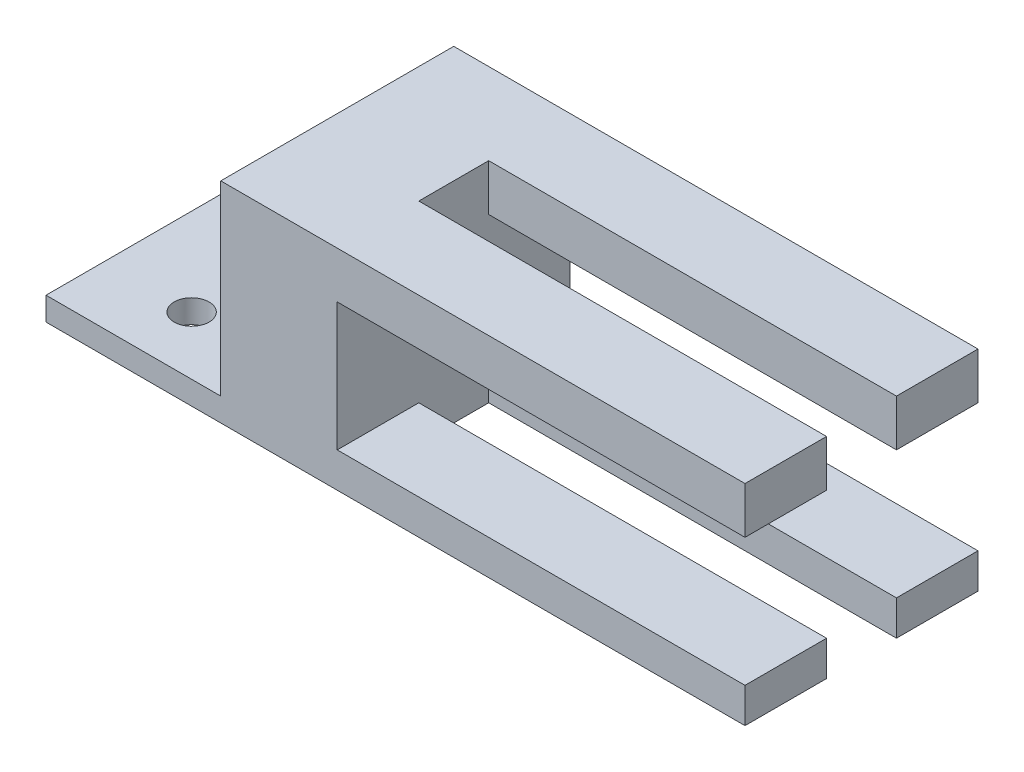
ISO-10303-21;
HEADER;
FILE_DESCRIPTION(('STEP AP214'),'2;1');
FILE_NAME('part.step','',(''),(''),'','','');
FILE_SCHEMA(('AUTOMOTIVE_DESIGN { 1 0 10303 214 1 1 1 1 }'));
ENDSEC;
DATA;
#1=APPLICATION_CONTEXT('core data for automotive mechanical design processes');
#2=APPLICATION_PROTOCOL_DEFINITION('international standard','automotive_design',2000,#1);
#3=PRODUCT_CONTEXT('',#1,'mechanical');
#4=PRODUCT('Part','Part','',(#3));
#5=PRODUCT_RELATED_PRODUCT_CATEGORY('part','',(#4));
#6=PRODUCT_DEFINITION_FORMATION('','',#4);
#7=PRODUCT_DEFINITION_CONTEXT('part definition',#1,'design');
#8=PRODUCT_DEFINITION('design','',#6,#7);
#9=PRODUCT_DEFINITION_SHAPE('','',#8);
#10=(LENGTH_UNIT() NAMED_UNIT(*) SI_UNIT(.MILLI.,.METRE.));
#11=(NAMED_UNIT(*) PLANE_ANGLE_UNIT() SI_UNIT($,.RADIAN.));
#12=(NAMED_UNIT(*) SI_UNIT($,.STERADIAN.) SOLID_ANGLE_UNIT());
#13=UNCERTAINTY_MEASURE_WITH_UNIT(LENGTH_MEASURE(1.E-05),#10,'distance_accuracy_value','');
#14=(GEOMETRIC_REPRESENTATION_CONTEXT(3) GLOBAL_UNCERTAINTY_ASSIGNED_CONTEXT((#13)) GLOBAL_UNIT_ASSIGNED_CONTEXT((#10,
#11,#12)) REPRESENTATION_CONTEXT('',''));
#15=CARTESIAN_POINT('',(0.,0.,0.));
#16=DIRECTION('',(0.,0.,1.));
#17=DIRECTION('',(1.,0.,0.));
#18=AXIS2_PLACEMENT_3D('',#15,#16,#17);
#19=CARTESIAN_POINT('',(5.,15.,-10.));
#20=DIRECTION('',(1.,0.,0.));
#21=DIRECTION('',(0.,1.,0.));
#22=AXIS2_PLACEMENT_3D('',#19,#20,#21);
#23=PLANE('',#22);
#24=DIRECTION('',(0.,0.,1.));
#25=VECTOR('',#24,1.);
#26=CARTESIAN_POINT('',(5.,11.,-10.));
#27=LINE('',#26,#25);
#28=CARTESIAN_POINT('',(5.,11.,-10.));
#29=VERTEX_POINT('',#28);
#30=CARTESIAN_POINT('',(5.,11.,-3.));
#31=VERTEX_POINT('',#30);
#32=EDGE_CURVE('E202',#29,#31,#27,.T.);
#33=ORIENTED_EDGE('',*,*,#32,.T.);
#34=DIRECTION('',(0.,1.,0.));
#35=VECTOR('',#34,1.);
#36=CARTESIAN_POINT('',(5.,15.,-3.));
#37=LINE('',#36,#35);
#38=CARTESIAN_POINT('',(5.,15.,-3.));
#39=VERTEX_POINT('',#38);
#40=EDGE_CURVE('E205',#31,#39,#37,.T.);
#41=ORIENTED_EDGE('',*,*,#40,.T.);
#42=DIRECTION('',(0.,0.,1.));
#43=VECTOR('',#42,1.);
#44=CARTESIAN_POINT('',(5.,15.,-10.));
#45=LINE('',#44,#43);
#46=CARTESIAN_POINT('',(5.,15.,3.));
#47=VERTEX_POINT('',#46);
#48=EDGE_CURVE('E310',#39,#47,#45,.T.);
#49=ORIENTED_EDGE('',*,*,#48,.T.);
#50=DIRECTION('',(0.,-1.,0.));
#51=VECTOR('',#50,1.);
#52=CARTESIAN_POINT('',(5.,15.,3.));
#53=LINE('',#52,#51);
#54=CARTESIAN_POINT('',(5.,11.,3.));
#55=VERTEX_POINT('',#54);
#56=EDGE_CURVE('E11',#47,#55,#53,.T.);
#57=ORIENTED_EDGE('',*,*,#56,.T.);
#58=DIRECTION('',(0.,0.,1.));
#59=VECTOR('',#58,1.);
#60=CARTESIAN_POINT('',(5.,11.,-10.));
#61=LINE('',#60,#59);
#62=CARTESIAN_POINT('',(5.,11.,10.));
#63=VERTEX_POINT('',#62);
#64=EDGE_CURVE('E272',#55,#63,#61,.T.);
#65=ORIENTED_EDGE('',*,*,#64,.T.);
#66=DIRECTION('',(0.,1.,0.));
#67=VECTOR('',#66,1.);
#68=CARTESIAN_POINT('',(5.,15.,10.));
#69=LINE('',#68,#67);
#70=CARTESIAN_POINT('',(5.,0.,10.));
#71=VERTEX_POINT('',#70);
#72=EDGE_CURVE('E300',#71,#63,#69,.T.);
#73=ORIENTED_EDGE('',*,*,#72,.F.);
#74=DIRECTION('',(0.,0.,-1.));
#75=VECTOR('',#74,1.);
#76=CARTESIAN_POINT('',(5.,0.,-10.));
#77=LINE('',#76,#75);
#78=CARTESIAN_POINT('',(5.,0.,3.));
#79=VERTEX_POINT('',#78);
#80=EDGE_CURVE('E247',#71,#79,#77,.T.);
#81=ORIENTED_EDGE('',*,*,#80,.T.);
#82=DIRECTION('',(0.,-1.,0.));
#83=VECTOR('',#82,1.);
#84=CARTESIAN_POINT('',(5.,15.,3.));
#85=LINE('',#84,#83);
#86=CARTESIAN_POINT('',(5.,-3.,3.));
#87=VERTEX_POINT('',#86);
#88=EDGE_CURVE('E250',#79,#87,#85,.T.);
#89=ORIENTED_EDGE('',*,*,#88,.T.);
#90=DIRECTION('',(0.,0.,1.));
#91=VECTOR('',#90,1.);
#92=CARTESIAN_POINT('',(5.00000000000001,-3.,-10.));
#93=LINE('',#92,#91);
#94=CARTESIAN_POINT('',(5.00000000000001,-3.,-3.));
#95=VERTEX_POINT('',#94);
#96=EDGE_CURVE('E174',#95,#87,#93,.T.);
#97=ORIENTED_EDGE('',*,*,#96,.F.);
#98=DIRECTION('',(0.,1.,0.));
#99=VECTOR('',#98,1.);
#100=CARTESIAN_POINT('',(5.,15.,-3.));
#101=LINE('',#100,#99);
#102=CARTESIAN_POINT('',(5.,0.,-3.));
#103=VERTEX_POINT('',#102);
#104=EDGE_CURVE('E227',#95,#103,#101,.T.);
#105=ORIENTED_EDGE('',*,*,#104,.T.);
#106=DIRECTION('',(0.,0.,-1.));
#107=VECTOR('',#106,1.);
#108=CARTESIAN_POINT('',(5.,0.,-10.));
#109=LINE('',#108,#107);
#110=CARTESIAN_POINT('',(5.,0.,-10.));
#111=VERTEX_POINT('',#110);
#112=EDGE_CURVE('E224',#103,#111,#109,.T.);
#113=ORIENTED_EDGE('',*,*,#112,.T.);
#114=DIRECTION('',(0.,1.,0.));
#115=VECTOR('',#114,1.);
#116=CARTESIAN_POINT('',(5.,15.,-10.));
#117=LINE('',#116,#115);
#118=EDGE_CURVE('E175',#111,#29,#117,.T.);
#119=ORIENTED_EDGE('',*,*,#118,.T.);
#120=EDGE_LOOP('',(#33,#41,#49,#57,#65,#73,#81,#89,#97,#105,#113,#119));
#121=FACE_BOUND('',#120,.T.);
#122=ADVANCED_FACE('F35',(#121),#23,.T.);
#123=CARTESIAN_POINT('',(-5.,15.,-10.));
#124=DIRECTION('',(-1.,0.,0.));
#125=DIRECTION('',(0.,-1.,0.));
#126=AXIS2_PLACEMENT_3D('',#123,#124,#125);
#127=PLANE('',#126);
#128=DIRECTION('',(0.,0.,-1.));
#129=VECTOR('',#128,1.);
#130=CARTESIAN_POINT('',(-4.99999999999999,-1.,-10.));
#131=LINE('',#130,#129);
#132=CARTESIAN_POINT('',(-4.99999999999999,-1.,10.));
#133=VERTEX_POINT('',#132);
#134=CARTESIAN_POINT('',(-4.99999999999999,-1.,-10.));
#135=VERTEX_POINT('',#134);
#136=EDGE_CURVE('E291',#133,#135,#131,.T.);
#137=ORIENTED_EDGE('',*,*,#136,.F.);
#138=DIRECTION('',(0.,-1.,0.));
#139=VECTOR('',#138,1.);
#140=CARTESIAN_POINT('',(-5.,15.,10.));
#141=LINE('',#140,#139);
#142=CARTESIAN_POINT('',(-5.,15.,10.));
#143=VERTEX_POINT('',#142);
#144=EDGE_CURVE('E295',#143,#133,#141,.T.);
#145=ORIENTED_EDGE('',*,*,#144,.F.);
#146=DIRECTION('',(0.,0.,1.));
#147=VECTOR('',#146,1.);
#148=CARTESIAN_POINT('',(-5.,15.,-10.));
#149=LINE('',#148,#147);
#150=CARTESIAN_POINT('',(-5.,15.,-10.));
#151=VERTEX_POINT('',#150);
#152=EDGE_CURVE('E44',#151,#143,#149,.T.);
#153=ORIENTED_EDGE('',*,*,#152,.F.);
#154=DIRECTION('',(0.,-1.,0.));
#155=VECTOR('',#154,1.);
#156=CARTESIAN_POINT('',(-5.,15.,-10.));
#157=LINE('',#156,#155);
#158=EDGE_CURVE('E170',#151,#135,#157,.T.);
#159=ORIENTED_EDGE('',*,*,#158,.T.);
#160=EDGE_LOOP('',(#137,#145,#153,#159));
#161=FACE_BOUND('',#160,.T.);
#162=ADVANCED_FACE('F37',(#161),#127,.T.);
#163=CARTESIAN_POINT('',(-5.,15.,-10.));
#164=DIRECTION('',(0.,1.,0.));
#165=DIRECTION('',(0.,0.,1.));
#166=AXIS2_PLACEMENT_3D('',#163,#164,#165);
#167=PLANE('',#166);
#168=ORIENTED_EDGE('',*,*,#48,.F.);
#169=DIRECTION('',(-1.,0.,0.));
#170=VECTOR('',#169,1.);
#171=CARTESIAN_POINT('',(40.,15.,-3.));
#172=LINE('',#171,#170);
#173=CARTESIAN_POINT('',(40.,15.,-3.));
#174=VERTEX_POINT('',#173);
#175=EDGE_CURVE('E181',#174,#39,#172,.T.);
#176=ORIENTED_EDGE('',*,*,#175,.F.);
#177=DIRECTION('',(0.,0.,1.));
#178=VECTOR('',#177,1.);
#179=CARTESIAN_POINT('',(40.,15.,-10.));
#180=LINE('',#179,#178);
#181=CARTESIAN_POINT('',(40.,15.,-10.));
#182=VERTEX_POINT('',#181);
#183=EDGE_CURVE('E178',#182,#174,#180,.T.);
#184=ORIENTED_EDGE('',*,*,#183,.F.);
#185=DIRECTION('',(-1.,0.,0.));
#186=VECTOR('',#185,1.);
#187=CARTESIAN_POINT('',(-5.,15.,-10.));
#188=LINE('',#187,#186);
#189=EDGE_CURVE('E163',#182,#151,#188,.T.);
#190=ORIENTED_EDGE('',*,*,#189,.T.);
#191=ORIENTED_EDGE('',*,*,#152,.T.);
#192=DIRECTION('',(-1.,0.,0.));
#193=VECTOR('',#192,1.);
#194=CARTESIAN_POINT('',(-5.,15.,10.));
#195=LINE('',#194,#193);
#196=CARTESIAN_POINT('',(40.,15.,10.));
#197=VERTEX_POINT('',#196);
#198=EDGE_CURVE('E302',#197,#143,#195,.T.);
#199=ORIENTED_EDGE('',*,*,#198,.F.);
#200=DIRECTION('',(0.,0.,1.));
#201=VECTOR('',#200,1.);
#202=CARTESIAN_POINT('',(40.,15.,10.));
#203=LINE('',#202,#201);
#204=CARTESIAN_POINT('',(40.,15.,3.));
#205=VERTEX_POINT('',#204);
#206=EDGE_CURVE('E260',#205,#197,#203,.T.);
#207=ORIENTED_EDGE('',*,*,#206,.F.);
#208=DIRECTION('',(-1.,0.,0.));
#209=VECTOR('',#208,1.);
#210=CARTESIAN_POINT('',(40.,15.,3.));
#211=LINE('',#210,#209);
#212=EDGE_CURVE('E263',#205,#47,#211,.T.);
#213=ORIENTED_EDGE('',*,*,#212,.T.);
#214=EDGE_LOOP('',(#168,#176,#184,#190,#191,#199,#207,#213));
#215=FACE_BOUND('',#214,.T.);
#216=ADVANCED_FACE('F180',(#215),#167,.T.);
#217=CARTESIAN_POINT('',(-4.99999999999999,-3.,-10.));
#218=DIRECTION('',(0.,-1.,0.));
#219=DIRECTION('',(0.,0.,-1.));
#220=AXIS2_PLACEMENT_3D('',#217,#218,#219);
#221=PLANE('',#220);
#222=CARTESIAN_POINT('',(-12.5,-3.,5.));
#223=DIRECTION('',(0.,-1.,0.));
#224=DIRECTION('',(0.,0.,-1.));
#225=AXIS2_PLACEMENT_3D('',#222,#223,#224);
#226=CIRCLE('',#225,1.5);
#227=CARTESIAN_POINT('',(-12.5,-3.,3.5));
#228=VERTEX_POINT('',#227);
#229=EDGE_CURVE('E313',#228,#228,#226,.T.);
#230=ORIENTED_EDGE('',*,*,#229,.F.);
#231=EDGE_LOOP('',(#230));
#232=FACE_BOUND('',#231,.T.);
#233=CARTESIAN_POINT('',(-12.5,-3.,-5.));
#234=DIRECTION('',(0.,-1.,0.));
#235=DIRECTION('',(0.,0.,-1.));
#236=AXIS2_PLACEMENT_3D('',#233,#234,#235);
#237=CIRCLE('',#236,1.5);
#238=CARTESIAN_POINT('',(-12.5,-3.,-6.5));
#239=VERTEX_POINT('',#238);
#240=EDGE_CURVE('E189',#239,#239,#237,.T.);
#241=ORIENTED_EDGE('',*,*,#240,.F.);
#242=EDGE_LOOP('',(#241));
#243=FACE_BOUND('',#242,.T.);
#244=DIRECTION('',(1.,0.,0.));
#245=VECTOR('',#244,1.);
#246=CARTESIAN_POINT('',(-4.99999999999999,-3.,-10.));
#247=LINE('',#246,#245);
#248=CARTESIAN_POINT('',(-20.,-3.,-10.));
#249=VERTEX_POINT('',#248);
#250=CARTESIAN_POINT('',(40.,-3.,-10.));
#251=VERTEX_POINT('',#250);
#252=EDGE_CURVE('E305',#249,#251,#247,.T.);
#253=ORIENTED_EDGE('',*,*,#252,.T.);
#254=DIRECTION('',(0.,0.,-1.));
#255=VECTOR('',#254,1.);
#256=CARTESIAN_POINT('',(40.,-3.,-10.));
#257=LINE('',#256,#255);
#258=CARTESIAN_POINT('',(40.,-3.,-3.));
#259=VERTEX_POINT('',#258);
#260=EDGE_CURVE('E215',#259,#251,#257,.T.);
#261=ORIENTED_EDGE('',*,*,#260,.F.);
#262=DIRECTION('',(-1.,0.,0.));
#263=VECTOR('',#262,1.);
#264=CARTESIAN_POINT('',(40.,-3.,-3.));
#265=LINE('',#264,#263);
#266=EDGE_CURVE('E60',#259,#95,#265,.T.);
#267=ORIENTED_EDGE('',*,*,#266,.T.);
#268=ORIENTED_EDGE('',*,*,#96,.T.);
#269=DIRECTION('',(-1.,0.,0.));
#270=VECTOR('',#269,1.);
#271=CARTESIAN_POINT('',(40.,-3.,3.));
#272=LINE('',#271,#270);
#273=CARTESIAN_POINT('',(40.,-3.,3.));
#274=VERTEX_POINT('',#273);
#275=EDGE_CURVE('E244',#274,#87,#272,.T.);
#276=ORIENTED_EDGE('',*,*,#275,.F.);
#277=DIRECTION('',(0.,0.,-1.));
#278=VECTOR('',#277,1.);
#279=CARTESIAN_POINT('',(40.,-3.,10.));
#280=LINE('',#279,#278);
#281=CARTESIAN_POINT('',(40.,-3.,10.));
#282=VERTEX_POINT('',#281);
#283=EDGE_CURVE('E233',#282,#274,#280,.T.);
#284=ORIENTED_EDGE('',*,*,#283,.F.);
#285=DIRECTION('',(1.,0.,0.));
#286=VECTOR('',#285,1.);
#287=CARTESIAN_POINT('',(-4.99999999999999,-3.,10.));
#288=LINE('',#287,#286);
#289=CARTESIAN_POINT('',(-20.,-3.,10.));
#290=VERTEX_POINT('',#289);
#291=EDGE_CURVE('E298',#290,#282,#288,.T.);
#292=ORIENTED_EDGE('',*,*,#291,.F.);
#293=DIRECTION('',(0.,0.,-1.));
#294=VECTOR('',#293,1.);
#295=CARTESIAN_POINT('',(-20.,-3.,10.));
#296=LINE('',#295,#294);
#297=EDGE_CURVE('E278',#290,#249,#296,.T.);
#298=ORIENTED_EDGE('',*,*,#297,.T.);
#299=EDGE_LOOP('',(#253,#261,#267,#268,#276,#284,#292,#298));
#300=FACE_BOUND('',#299,.T.);
#301=ADVANCED_FACE('F338',(#232,#243,#300),#221,.T.);
#302=CARTESIAN_POINT('',(0.,0.,-10.));
#303=DIRECTION('',(0.,0.,1.));
#304=DIRECTION('',(1.,0.,0.));
#305=AXIS2_PLACEMENT_3D('',#302,#303,#304);
#306=PLANE('',#305);
#307=ORIENTED_EDGE('',*,*,#189,.F.);
#308=DIRECTION('',(0.,1.,0.));
#309=VECTOR('',#308,1.);
#310=CARTESIAN_POINT('',(40.,15.,-10.));
#311=LINE('',#310,#309);
#312=CARTESIAN_POINT('',(40.,11.,-10.));
#313=VERTEX_POINT('',#312);
#314=EDGE_CURVE('E168',#313,#182,#311,.T.);
#315=ORIENTED_EDGE('',*,*,#314,.F.);
#316=DIRECTION('',(-1.,0.,0.));
#317=VECTOR('',#316,1.);
#318=CARTESIAN_POINT('',(40.,11.,-10.));
#319=LINE('',#318,#317);
#320=EDGE_CURVE('E198',#313,#29,#319,.T.);
#321=ORIENTED_EDGE('',*,*,#320,.T.);
#322=ORIENTED_EDGE('',*,*,#118,.F.);
#323=DIRECTION('',(-1.,0.,0.));
#324=VECTOR('',#323,1.);
#325=CARTESIAN_POINT('',(40.,0.,-10.));
#326=LINE('',#325,#324);
#327=CARTESIAN_POINT('',(40.,0.,-10.));
#328=VERTEX_POINT('',#327);
#329=EDGE_CURVE('E222',#328,#111,#326,.T.);
#330=ORIENTED_EDGE('',*,*,#329,.F.);
#331=DIRECTION('',(0.,1.,0.));
#332=VECTOR('',#331,1.);
#333=CARTESIAN_POINT('',(40.,0.,-10.));
#334=LINE('',#333,#332);
#335=EDGE_CURVE('E208',#251,#328,#334,.T.);
#336=ORIENTED_EDGE('',*,*,#335,.F.);
#337=ORIENTED_EDGE('',*,*,#252,.F.);
#338=DIRECTION('',(0.,1.,0.));
#339=VECTOR('',#338,1.);
#340=CARTESIAN_POINT('',(-20.,-3.,-10.));
#341=LINE('',#340,#339);
#342=CARTESIAN_POINT('',(-20.,-0.999999999999999,-10.));
#343=VERTEX_POINT('',#342);
#344=EDGE_CURVE('E281',#249,#343,#341,.T.);
#345=ORIENTED_EDGE('',*,*,#344,.T.);
#346=DIRECTION('',(1.,0.,0.));
#347=VECTOR('',#346,1.);
#348=CARTESIAN_POINT('',(-20.,-0.999999999999999,-10.));
#349=LINE('',#348,#347);
#350=EDGE_CURVE('E287',#343,#135,#349,.T.);
#351=ORIENTED_EDGE('',*,*,#350,.T.);
#352=ORIENTED_EDGE('',*,*,#158,.F.);
#353=EDGE_LOOP('',(#307,#315,#321,#322,#330,#336,#337,#345,#351,#352));
#354=FACE_BOUND('',#353,.T.);
#355=ADVANCED_FACE('F165',(#354),#306,.F.);
#356=CARTESIAN_POINT('',(0.,0.,10.));
#357=DIRECTION('',(0.,0.,1.));
#358=DIRECTION('',(1.,0.,0.));
#359=AXIS2_PLACEMENT_3D('',#356,#357,#358);
#360=PLANE('',#359);
#361=ORIENTED_EDGE('',*,*,#291,.T.);
#362=DIRECTION('',(0.,-1.,0.));
#363=VECTOR('',#362,1.);
#364=CARTESIAN_POINT('',(40.,0.,10.));
#365=LINE('',#364,#363);
#366=CARTESIAN_POINT('',(40.,0.,10.));
#367=VERTEX_POINT('',#366);
#368=EDGE_CURVE('E230',#367,#282,#365,.T.);
#369=ORIENTED_EDGE('',*,*,#368,.F.);
#370=DIRECTION('',(-1.,0.,0.));
#371=VECTOR('',#370,1.);
#372=CARTESIAN_POINT('',(40.,0.,10.));
#373=LINE('',#372,#371);
#374=EDGE_CURVE('E239',#367,#71,#373,.T.);
#375=ORIENTED_EDGE('',*,*,#374,.T.);
#376=ORIENTED_EDGE('',*,*,#72,.T.);
#377=DIRECTION('',(-1.,0.,0.));
#378=VECTOR('',#377,1.);
#379=CARTESIAN_POINT('',(40.,11.,10.));
#380=LINE('',#379,#378);
#381=CARTESIAN_POINT('',(40.,11.,10.));
#382=VERTEX_POINT('',#381);
#383=EDGE_CURVE('E269',#382,#63,#380,.T.);
#384=ORIENTED_EDGE('',*,*,#383,.F.);
#385=DIRECTION('',(0.,-1.,0.));
#386=VECTOR('',#385,1.);
#387=CARTESIAN_POINT('',(40.,15.,10.));
#388=LINE('',#387,#386);
#389=EDGE_CURVE('E253',#197,#382,#388,.T.);
#390=ORIENTED_EDGE('',*,*,#389,.F.);
#391=ORIENTED_EDGE('',*,*,#198,.T.);
#392=ORIENTED_EDGE('',*,*,#144,.T.);
#393=DIRECTION('',(1.,0.,0.));
#394=VECTOR('',#393,1.);
#395=CARTESIAN_POINT('',(-20.,-0.999999999999999,10.));
#396=LINE('',#395,#394);
#397=CARTESIAN_POINT('',(-20.,-0.999999999999999,10.));
#398=VERTEX_POINT('',#397);
#399=EDGE_CURVE('E288',#398,#133,#396,.T.);
#400=ORIENTED_EDGE('',*,*,#399,.F.);
#401=DIRECTION('',(0.,-1.,0.));
#402=VECTOR('',#401,1.);
#403=CARTESIAN_POINT('',(-20.,-3.,10.));
#404=LINE('',#403,#402);
#405=EDGE_CURVE('E275',#398,#290,#404,.T.);
#406=ORIENTED_EDGE('',*,*,#405,.T.);
#407=EDGE_LOOP('',(#361,#369,#375,#376,#384,#390,#391,#392,#400,#406));
#408=FACE_BOUND('',#407,.T.);
#409=ADVANCED_FACE('F328',(#408),#360,.T.);
#410=CARTESIAN_POINT('',(-20.,-0.999999999999999,10.));
#411=DIRECTION('',(0.,1.,0.));
#412=DIRECTION('',(0.,0.,1.));
#413=AXIS2_PLACEMENT_3D('',#410,#411,#412);
#414=PLANE('',#413);
#415=CARTESIAN_POINT('',(-12.5,-0.999999999999999,5.));
#416=DIRECTION('',(0.,1.,0.));
#417=DIRECTION('',(0.,0.,1.));
#418=AXIS2_PLACEMENT_3D('',#415,#416,#417);
#419=CIRCLE('',#418,1.5);
#420=CARTESIAN_POINT('',(-12.5,-0.999999999999999,6.5));
#421=VERTEX_POINT('',#420);
#422=EDGE_CURVE('E39',#421,#421,#419,.T.);
#423=ORIENTED_EDGE('',*,*,#422,.F.);
#424=EDGE_LOOP('',(#423));
#425=FACE_BOUND('',#424,.T.);
#426=CARTESIAN_POINT('',(-12.5,-0.999999999999999,-5.));
#427=DIRECTION('',(0.,1.,0.));
#428=DIRECTION('',(0.,0.,1.));
#429=AXIS2_PLACEMENT_3D('',#426,#427,#428);
#430=CIRCLE('',#429,1.5);
#431=CARTESIAN_POINT('',(-12.5,-0.999999999999999,-3.5));
#432=VERTEX_POINT('',#431);
#433=EDGE_CURVE('E192',#432,#432,#430,.T.);
#434=ORIENTED_EDGE('',*,*,#433,.F.);
#435=EDGE_LOOP('',(#434));
#436=FACE_BOUND('',#435,.T.);
#437=ORIENTED_EDGE('',*,*,#399,.T.);
#438=ORIENTED_EDGE('',*,*,#136,.T.);
#439=ORIENTED_EDGE('',*,*,#350,.F.);
#440=DIRECTION('',(0.,0.,1.));
#441=VECTOR('',#440,1.);
#442=CARTESIAN_POINT('',(-20.,-0.999999999999999,10.));
#443=LINE('',#442,#441);
#444=EDGE_CURVE('E284',#343,#398,#443,.T.);
#445=ORIENTED_EDGE('',*,*,#444,.T.);
#446=EDGE_LOOP('',(#437,#438,#439,#445));
#447=FACE_BOUND('',#446,.T.);
#448=ADVANCED_FACE('F324',(#425,#436,#447),#414,.T.);
#449=CARTESIAN_POINT('',(-20.,0.,0.));
#450=DIRECTION('',(-1.,0.,0.));
#451=DIRECTION('',(0.,0.,1.));
#452=AXIS2_PLACEMENT_3D('',#449,#450,#451);
#453=PLANE('',#452);
#454=ORIENTED_EDGE('',*,*,#405,.F.);
#455=ORIENTED_EDGE('',*,*,#444,.F.);
#456=ORIENTED_EDGE('',*,*,#344,.F.);
#457=ORIENTED_EDGE('',*,*,#297,.F.);
#458=EDGE_LOOP('',(#454,#455,#456,#457));
#459=FACE_BOUND('',#458,.T.);
#460=ADVANCED_FACE('F327',(#459),#453,.T.);
#461=CARTESIAN_POINT('',(40.,11.,10.));
#462=DIRECTION('',(0.,1.,0.));
#463=DIRECTION('',(0.,0.,1.));
#464=AXIS2_PLACEMENT_3D('',#461,#462,#463);
#465=PLANE('',#464);
#466=ORIENTED_EDGE('',*,*,#64,.F.);
#467=DIRECTION('',(-1.,0.,0.));
#468=VECTOR('',#467,1.);
#469=CARTESIAN_POINT('',(40.,11.,3.));
#470=LINE('',#469,#468);
#471=CARTESIAN_POINT('',(40.,11.,3.));
#472=VERTEX_POINT('',#471);
#473=EDGE_CURVE('E266',#472,#55,#470,.T.);
#474=ORIENTED_EDGE('',*,*,#473,.F.);
#475=DIRECTION('',(0.,0.,-1.));
#476=VECTOR('',#475,1.);
#477=CARTESIAN_POINT('',(40.,11.,10.));
#478=LINE('',#477,#476);
#479=EDGE_CURVE('E256',#382,#472,#478,.T.);
#480=ORIENTED_EDGE('',*,*,#479,.F.);
#481=ORIENTED_EDGE('',*,*,#383,.T.);
#482=EDGE_LOOP('',(#466,#474,#480,#481));
#483=FACE_BOUND('',#482,.T.);
#484=ADVANCED_FACE('F358',(#483),#465,.F.);
#485=CARTESIAN_POINT('',(40.,15.,3.));
#486=DIRECTION('',(0.,0.,1.));
#487=DIRECTION('',(0.,-1.,0.));
#488=AXIS2_PLACEMENT_3D('',#485,#486,#487);
#489=PLANE('',#488);
#490=ORIENTED_EDGE('',*,*,#56,.F.);
#491=ORIENTED_EDGE('',*,*,#212,.F.);
#492=DIRECTION('',(0.,1.,0.));
#493=VECTOR('',#492,1.);
#494=CARTESIAN_POINT('',(40.,15.,3.));
#495=LINE('',#494,#493);
#496=EDGE_CURVE('E258',#472,#205,#495,.T.);
#497=ORIENTED_EDGE('',*,*,#496,.F.);
#498=ORIENTED_EDGE('',*,*,#473,.T.);
#499=EDGE_LOOP('',(#490,#491,#497,#498));
#500=FACE_BOUND('',#499,.T.);
#501=ADVANCED_FACE('F423',(#500),#489,.F.);
#502=CARTESIAN_POINT('',(40.,0.,0.));
#503=DIRECTION('',(1.,0.,0.));
#504=DIRECTION('',(0.,0.,-1.));
#505=AXIS2_PLACEMENT_3D('',#502,#503,#504);
#506=PLANE('',#505);
#507=ORIENTED_EDGE('',*,*,#389,.T.);
#508=ORIENTED_EDGE('',*,*,#479,.T.);
#509=ORIENTED_EDGE('',*,*,#496,.T.);
#510=ORIENTED_EDGE('',*,*,#206,.T.);
#511=EDGE_LOOP('',(#507,#508,#509,#510));
#512=FACE_BOUND('',#511,.T.);
#513=ADVANCED_FACE('F362',(#512),#506,.T.);
#514=CARTESIAN_POINT('',(40.,0.,3.));
#515=DIRECTION('',(0.,0.,1.));
#516=DIRECTION('',(0.,-1.,0.));
#517=AXIS2_PLACEMENT_3D('',#514,#515,#516);
#518=PLANE('',#517);
#519=ORIENTED_EDGE('',*,*,#88,.F.);
#520=DIRECTION('',(-1.,0.,0.));
#521=VECTOR('',#520,1.);
#522=CARTESIAN_POINT('',(40.,0.,3.));
#523=LINE('',#522,#521);
#524=CARTESIAN_POINT('',(40.,0.,3.));
#525=VERTEX_POINT('',#524);
#526=EDGE_CURVE('E242',#525,#79,#523,.T.);
#527=ORIENTED_EDGE('',*,*,#526,.F.);
#528=DIRECTION('',(0.,1.,0.));
#529=VECTOR('',#528,1.);
#530=CARTESIAN_POINT('',(40.,0.,3.));
#531=LINE('',#530,#529);
#532=EDGE_CURVE('E235',#274,#525,#531,.T.);
#533=ORIENTED_EDGE('',*,*,#532,.F.);
#534=ORIENTED_EDGE('',*,*,#275,.T.);
#535=EDGE_LOOP('',(#519,#527,#533,#534));
#536=FACE_BOUND('',#535,.T.);
#537=ADVANCED_FACE('F417',(#536),#518,.F.);
#538=CARTESIAN_POINT('',(40.,0.,10.));
#539=DIRECTION('',(0.,-1.,0.));
#540=DIRECTION('',(0.,0.,-1.));
#541=AXIS2_PLACEMENT_3D('',#538,#539,#540);
#542=PLANE('',#541);
#543=ORIENTED_EDGE('',*,*,#80,.F.);
#544=ORIENTED_EDGE('',*,*,#374,.F.);
#545=DIRECTION('',(0.,0.,1.));
#546=VECTOR('',#545,1.);
#547=CARTESIAN_POINT('',(40.,0.,10.));
#548=LINE('',#547,#546);
#549=EDGE_CURVE('E237',#525,#367,#548,.T.);
#550=ORIENTED_EDGE('',*,*,#549,.F.);
#551=ORIENTED_EDGE('',*,*,#526,.T.);
#552=EDGE_LOOP('',(#543,#544,#550,#551));
#553=FACE_BOUND('',#552,.T.);
#554=ADVANCED_FACE('F350',(#553),#542,.F.);
#555=CARTESIAN_POINT('',(40.,0.,0.));
#556=DIRECTION('',(1.,0.,0.));
#557=DIRECTION('',(0.,0.,-1.));
#558=AXIS2_PLACEMENT_3D('',#555,#556,#557);
#559=PLANE('',#558);
#560=ORIENTED_EDGE('',*,*,#368,.T.);
#561=ORIENTED_EDGE('',*,*,#283,.T.);
#562=ORIENTED_EDGE('',*,*,#532,.T.);
#563=ORIENTED_EDGE('',*,*,#549,.T.);
#564=EDGE_LOOP('',(#560,#561,#562,#563));
#565=FACE_BOUND('',#564,.T.);
#566=ADVANCED_FACE('F345',(#565),#559,.T.);
#567=CARTESIAN_POINT('',(40.,0.,-10.));
#568=DIRECTION('',(0.,-1.,0.));
#569=DIRECTION('',(0.,0.,-1.));
#570=AXIS2_PLACEMENT_3D('',#567,#568,#569);
#571=PLANE('',#570);
#572=ORIENTED_EDGE('',*,*,#112,.F.);
#573=DIRECTION('',(-1.,0.,0.));
#574=VECTOR('',#573,1.);
#575=CARTESIAN_POINT('',(40.,0.,-3.));
#576=LINE('',#575,#574);
#577=CARTESIAN_POINT('',(40.,0.,-3.));
#578=VERTEX_POINT('',#577);
#579=EDGE_CURVE('E219',#578,#103,#576,.T.);
#580=ORIENTED_EDGE('',*,*,#579,.F.);
#581=DIRECTION('',(0.,0.,1.));
#582=VECTOR('',#581,1.);
#583=CARTESIAN_POINT('',(40.,0.,-10.));
#584=LINE('',#583,#582);
#585=EDGE_CURVE('E211',#328,#578,#584,.T.);
#586=ORIENTED_EDGE('',*,*,#585,.F.);
#587=ORIENTED_EDGE('',*,*,#329,.T.);
#588=EDGE_LOOP('',(#572,#580,#586,#587));
#589=FACE_BOUND('',#588,.T.);
#590=ADVANCED_FACE('F408',(#589),#571,.F.);
#591=CARTESIAN_POINT('',(40.,0.,-3.));
#592=DIRECTION('',(0.,0.,-1.));
#593=DIRECTION('',(0.,1.,0.));
#594=AXIS2_PLACEMENT_3D('',#591,#592,#593);
#595=PLANE('',#594);
#596=ORIENTED_EDGE('',*,*,#104,.F.);
#597=ORIENTED_EDGE('',*,*,#266,.F.);
#598=DIRECTION('',(0.,-1.,0.));
#599=VECTOR('',#598,1.);
#600=CARTESIAN_POINT('',(40.,0.,-3.));
#601=LINE('',#600,#599);
#602=EDGE_CURVE('E213',#578,#259,#601,.T.);
#603=ORIENTED_EDGE('',*,*,#602,.F.);
#604=ORIENTED_EDGE('',*,*,#579,.T.);
#605=EDGE_LOOP('',(#596,#597,#603,#604));
#606=FACE_BOUND('',#605,.T.);
#607=ADVANCED_FACE('F404',(#606),#595,.F.);
#608=CARTESIAN_POINT('',(40.,0.,0.));
#609=DIRECTION('',(-1.,0.,0.));
#610=DIRECTION('',(0.,0.,1.));
#611=AXIS2_PLACEMENT_3D('',#608,#609,#610);
#612=PLANE('',#611);
#613=ORIENTED_EDGE('',*,*,#335,.T.);
#614=ORIENTED_EDGE('',*,*,#585,.T.);
#615=ORIENTED_EDGE('',*,*,#602,.T.);
#616=ORIENTED_EDGE('',*,*,#260,.T.);
#617=EDGE_LOOP('',(#613,#614,#615,#616));
#618=FACE_BOUND('',#617,.T.);
#619=ADVANCED_FACE('F400',(#618),#612,.F.);
#620=CARTESIAN_POINT('',(40.,15.,-3.));
#621=DIRECTION('',(0.,0.,-1.));
#622=DIRECTION('',(0.,1.,0.));
#623=AXIS2_PLACEMENT_3D('',#620,#621,#622);
#624=PLANE('',#623);
#625=ORIENTED_EDGE('',*,*,#40,.F.);
#626=DIRECTION('',(-1.,0.,0.));
#627=VECTOR('',#626,1.);
#628=CARTESIAN_POINT('',(40.,11.,-3.));
#629=LINE('',#628,#627);
#630=CARTESIAN_POINT('',(40.,11.,-3.));
#631=VERTEX_POINT('',#630);
#632=EDGE_CURVE('E52',#631,#31,#629,.T.);
#633=ORIENTED_EDGE('',*,*,#632,.F.);
#634=DIRECTION('',(0.,-1.,0.));
#635=VECTOR('',#634,1.);
#636=CARTESIAN_POINT('',(40.,15.,-3.));
#637=LINE('',#636,#635);
#638=EDGE_CURVE('E184',#174,#631,#637,.T.);
#639=ORIENTED_EDGE('',*,*,#638,.F.);
#640=ORIENTED_EDGE('',*,*,#175,.T.);
#641=EDGE_LOOP('',(#625,#633,#639,#640));
#642=FACE_BOUND('',#641,.T.);
#643=ADVANCED_FACE('F397',(#642),#624,.F.);
#644=CARTESIAN_POINT('',(40.,11.,-10.));
#645=DIRECTION('',(0.,1.,0.));
#646=DIRECTION('',(0.,0.,1.));
#647=AXIS2_PLACEMENT_3D('',#644,#645,#646);
#648=PLANE('',#647);
#649=ORIENTED_EDGE('',*,*,#32,.F.);
#650=ORIENTED_EDGE('',*,*,#320,.F.);
#651=DIRECTION('',(0.,0.,-1.));
#652=VECTOR('',#651,1.);
#653=CARTESIAN_POINT('',(40.,11.,-10.));
#654=LINE('',#653,#652);
#655=EDGE_CURVE('E187',#631,#313,#654,.T.);
#656=ORIENTED_EDGE('',*,*,#655,.F.);
#657=ORIENTED_EDGE('',*,*,#632,.T.);
#658=EDGE_LOOP('',(#649,#650,#656,#657));
#659=FACE_BOUND('',#658,.T.);
#660=ADVANCED_FACE('F392',(#659),#648,.F.);
#661=CARTESIAN_POINT('',(40.,0.,0.));
#662=DIRECTION('',(-1.,0.,0.));
#663=DIRECTION('',(0.,0.,1.));
#664=AXIS2_PLACEMENT_3D('',#661,#662,#663);
#665=PLANE('',#664);
#666=ORIENTED_EDGE('',*,*,#314,.T.);
#667=ORIENTED_EDGE('',*,*,#183,.T.);
#668=ORIENTED_EDGE('',*,*,#638,.T.);
#669=ORIENTED_EDGE('',*,*,#655,.T.);
#670=EDGE_LOOP('',(#666,#667,#668,#669));
#671=FACE_BOUND('',#670,.T.);
#672=ADVANCED_FACE('F186',(#671),#665,.F.);
#673=CARTESIAN_POINT('',(-12.5,-10.,-5.));
#674=DIRECTION('',(0.,1.,0.));
#675=DIRECTION('',(0.,0.,1.));
#676=AXIS2_PLACEMENT_3D('',#673,#674,#675);
#677=CYLINDRICAL_SURFACE('',#676,1.5);
#678=ORIENTED_EDGE('',*,*,#240,.T.);
#679=EDGE_LOOP('',(#678));
#680=FACE_BOUND('',#679,.T.);
#681=ORIENTED_EDGE('',*,*,#433,.T.);
#682=EDGE_LOOP('',(#681));
#683=FACE_BOUND('',#682,.T.);
#684=ADVANCED_FACE('F384',(#680,#683),#677,.F.);
#685=CARTESIAN_POINT('',(-12.5,-10.,5.));
#686=DIRECTION('',(0.,1.,0.));
#687=DIRECTION('',(0.,0.,1.));
#688=AXIS2_PLACEMENT_3D('',#685,#686,#687);
#689=CYLINDRICAL_SURFACE('',#688,1.5);
#690=ORIENTED_EDGE('',*,*,#229,.T.);
#691=EDGE_LOOP('',(#690));
#692=FACE_BOUND('',#691,.T.);
#693=ORIENTED_EDGE('',*,*,#422,.T.);
#694=EDGE_LOOP('',(#693));
#695=FACE_BOUND('',#694,.T.);
#696=ADVANCED_FACE('F322',(#692,#695),#689,.F.);
#697=CLOSED_SHELL('',(#122,#162,#216,#301,#355,#409,#448,#460,#484,#501,#513,#537,#554,#566,
#590,#607,#619,#643,#660,#672,#684,#696));
#698=MANIFOLD_SOLID_BREP('B2',#697);
#699=ADVANCED_BREP_SHAPE_REPRESENTATION('',(#18,#698),#14);
#700=SHAPE_DEFINITION_REPRESENTATION(#9,#699);
ENDSEC;
END-ISO-10303-21;
